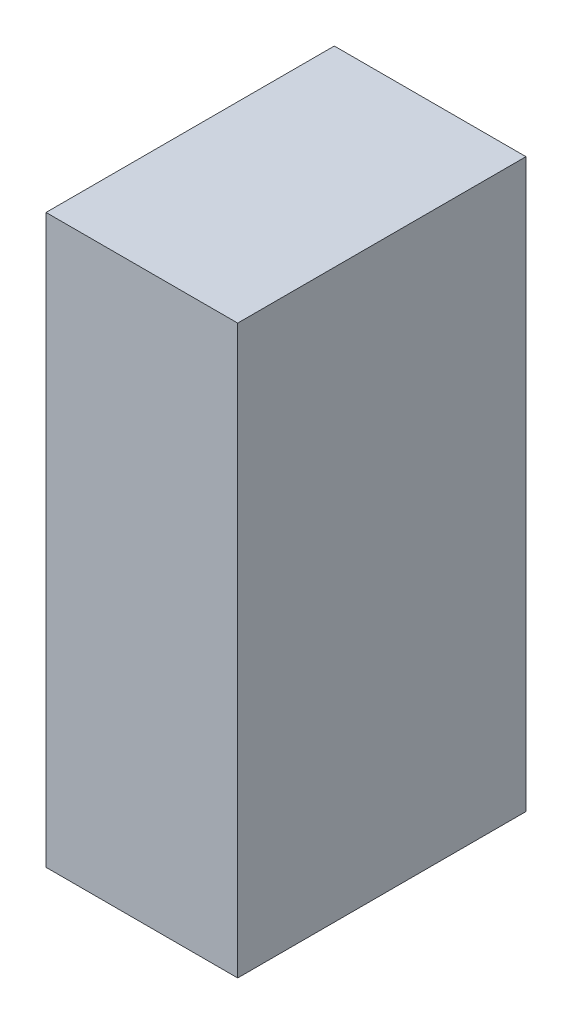
ISO-10303-21;
HEADER;
FILE_DESCRIPTION(('STEP AP214'),'2;1');
FILE_NAME('part.step','',(''),(''),'','','');
FILE_SCHEMA(('AUTOMOTIVE_DESIGN { 1 0 10303 214 1 1 1 1 }'));
ENDSEC;
DATA;
#1=APPLICATION_CONTEXT('core data for automotive mechanical design processes');
#2=APPLICATION_PROTOCOL_DEFINITION('international standard','automotive_design',2000,#1);
#3=PRODUCT_CONTEXT('',#1,'mechanical');
#4=PRODUCT('Part','Part','',(#3));
#5=PRODUCT_RELATED_PRODUCT_CATEGORY('part','',(#4));
#6=PRODUCT_DEFINITION_FORMATION('','',#4);
#7=PRODUCT_DEFINITION_CONTEXT('part definition',#1,'design');
#8=PRODUCT_DEFINITION('design','',#6,#7);
#9=PRODUCT_DEFINITION_SHAPE('','',#8);
#10=(LENGTH_UNIT() NAMED_UNIT(*) SI_UNIT(.MILLI.,.METRE.));
#11=(NAMED_UNIT(*) PLANE_ANGLE_UNIT() SI_UNIT($,.RADIAN.));
#12=(NAMED_UNIT(*) SI_UNIT($,.STERADIAN.) SOLID_ANGLE_UNIT());
#13=UNCERTAINTY_MEASURE_WITH_UNIT(LENGTH_MEASURE(1.E-05),#10,'distance_accuracy_value','');
#14=(GEOMETRIC_REPRESENTATION_CONTEXT(3) GLOBAL_UNCERTAINTY_ASSIGNED_CONTEXT((#13)) GLOBAL_UNIT_ASSIGNED_CONTEXT((#10,
#11,#12)) REPRESENTATION_CONTEXT('',''));
#15=CARTESIAN_POINT('',(0.,0.,0.));
#16=DIRECTION('',(0.,0.,1.));
#17=DIRECTION('',(1.,0.,0.));
#18=AXIS2_PLACEMENT_3D('',#15,#16,#17);
#19=CARTESIAN_POINT('',(-0.33774126,-0.99949,0.));
#20=DIRECTION('',(0.,1.,0.));
#21=DIRECTION('',(1.,0.,0.));
#22=AXIS2_PLACEMENT_3D('',#19,#20,#21);
#23=PLANE('',#22);
#24=DIRECTION('',(1.,0.,0.));
#25=VECTOR('',#24,1.);
#26=CARTESIAN_POINT('',(-0.33774126,-0.99949,0.));
#27=LINE('',#26,#25);
#28=CARTESIAN_POINT('',(-0.33774126,-0.99949,0.));
#29=VERTEX_POINT('',#28);
#30=CARTESIAN_POINT('',(0.3377438,-0.99949,0.));
#31=VERTEX_POINT('',#30);
#32=EDGE_CURVE('E11',#29,#31,#27,.T.);
#33=ORIENTED_EDGE('',*,*,#32,.T.);
#34=DIRECTION('',(0.,0.,1.));
#35=VECTOR('',#34,1.);
#36=CARTESIAN_POINT('',(0.3377438,-0.99949,0.));
#37=LINE('',#36,#35);
#38=CARTESIAN_POINT('',(0.3377438,-0.99949,1.016));
#39=VERTEX_POINT('',#38);
#40=EDGE_CURVE('E24',#31,#39,#37,.T.);
#41=ORIENTED_EDGE('',*,*,#40,.T.);
#42=DIRECTION('',(1.,0.,0.));
#43=VECTOR('',#42,1.);
#44=CARTESIAN_POINT('',(-0.33774126,-0.99949,1.016));
#45=LINE('',#44,#43);
#46=CARTESIAN_POINT('',(-0.33774126,-0.99949,1.016));
#47=VERTEX_POINT('',#46);
#48=EDGE_CURVE('E87',#47,#39,#45,.T.);
#49=ORIENTED_EDGE('',*,*,#48,.F.);
#50=DIRECTION('',(0.,0.,1.));
#51=VECTOR('',#50,1.);
#52=CARTESIAN_POINT('',(-0.33774126,-0.99949,0.));
#53=LINE('',#52,#51);
#54=EDGE_CURVE('E36',#29,#47,#53,.T.);
#55=ORIENTED_EDGE('',*,*,#54,.F.);
#56=EDGE_LOOP('',(#33,#41,#49,#55));
#57=FACE_BOUND('',#56,.T.);
#58=ADVANCED_FACE('F17',(#57),#23,.F.);
#59=CARTESIAN_POINT('',(0.3377438,-0.99949,0.));
#60=DIRECTION('',(-1.,0.,0.));
#61=DIRECTION('',(0.,1.,0.));
#62=AXIS2_PLACEMENT_3D('',#59,#60,#61);
#63=PLANE('',#62);
#64=DIRECTION('',(0.,1.,0.));
#65=VECTOR('',#64,1.);
#66=CARTESIAN_POINT('',(0.3377438,-0.99949,0.));
#67=LINE('',#66,#65);
#68=CARTESIAN_POINT('',(0.3377438,0.99949254,0.));
#69=VERTEX_POINT('',#68);
#70=EDGE_CURVE('E84',#31,#69,#67,.T.);
#71=ORIENTED_EDGE('',*,*,#70,.T.);
#72=DIRECTION('',(0.,0.,1.));
#73=VECTOR('',#72,1.);
#74=CARTESIAN_POINT('',(0.3377438,0.99949254,0.));
#75=LINE('',#74,#73);
#76=CARTESIAN_POINT('',(0.3377438,0.99949254,1.016));
#77=VERTEX_POINT('',#76);
#78=EDGE_CURVE('E82',#69,#77,#75,.T.);
#79=ORIENTED_EDGE('',*,*,#78,.T.);
#80=DIRECTION('',(0.,1.,0.));
#81=VECTOR('',#80,1.);
#82=CARTESIAN_POINT('',(0.3377438,-0.99949,1.016));
#83=LINE('',#82,#81);
#84=EDGE_CURVE('E62',#39,#77,#83,.T.);
#85=ORIENTED_EDGE('',*,*,#84,.F.);
#86=ORIENTED_EDGE('',*,*,#40,.F.);
#87=EDGE_LOOP('',(#71,#79,#85,#86));
#88=FACE_BOUND('',#87,.T.);
#89=ADVANCED_FACE('F89',(#88),#63,.F.);
#90=CARTESIAN_POINT('',(0.3377438,0.99949254,0.));
#91=DIRECTION('',(0.,-1.,0.));
#92=DIRECTION('',(-1.,0.,0.));
#93=AXIS2_PLACEMENT_3D('',#90,#91,#92);
#94=PLANE('',#93);
#95=DIRECTION('',(-1.,0.,0.));
#96=VECTOR('',#95,1.);
#97=CARTESIAN_POINT('',(0.3377438,0.99949254,0.));
#98=LINE('',#97,#96);
#99=CARTESIAN_POINT('',(-0.33774126,0.99949254,0.));
#100=VERTEX_POINT('',#99);
#101=EDGE_CURVE('E71',#69,#100,#98,.T.);
#102=ORIENTED_EDGE('',*,*,#101,.T.);
#103=DIRECTION('',(0.,0.,1.));
#104=VECTOR('',#103,1.);
#105=CARTESIAN_POINT('',(-0.33774126,0.99949254,0.));
#106=LINE('',#105,#104);
#107=CARTESIAN_POINT('',(-0.33774126,0.99949254,1.016));
#108=VERTEX_POINT('',#107);
#109=EDGE_CURVE('E65',#100,#108,#106,.T.);
#110=ORIENTED_EDGE('',*,*,#109,.T.);
#111=DIRECTION('',(-1.,0.,0.));
#112=VECTOR('',#111,1.);
#113=CARTESIAN_POINT('',(0.3377438,0.99949254,1.016));
#114=LINE('',#113,#112);
#115=EDGE_CURVE('E57',#77,#108,#114,.T.);
#116=ORIENTED_EDGE('',*,*,#115,.F.);
#117=ORIENTED_EDGE('',*,*,#78,.F.);
#118=EDGE_LOOP('',(#102,#110,#116,#117));
#119=FACE_BOUND('',#118,.T.);
#120=ADVANCED_FACE('F69',(#119),#94,.F.);
#121=CARTESIAN_POINT('',(-0.33774126,0.99949254,0.));
#122=DIRECTION('',(1.,0.,0.));
#123=DIRECTION('',(0.,-1.,0.));
#124=AXIS2_PLACEMENT_3D('',#121,#122,#123);
#125=PLANE('',#124);
#126=DIRECTION('',(0.,-1.,0.));
#127=VECTOR('',#126,1.);
#128=CARTESIAN_POINT('',(-0.33774126,0.99949254,0.));
#129=LINE('',#128,#127);
#130=EDGE_CURVE('E66',#100,#29,#129,.T.);
#131=ORIENTED_EDGE('',*,*,#130,.T.);
#132=ORIENTED_EDGE('',*,*,#54,.T.);
#133=DIRECTION('',(0.,-1.,0.));
#134=VECTOR('',#133,1.);
#135=CARTESIAN_POINT('',(-0.33774126,0.99949254,1.016));
#136=LINE('',#135,#134);
#137=EDGE_CURVE('E61',#108,#47,#136,.T.);
#138=ORIENTED_EDGE('',*,*,#137,.F.);
#139=ORIENTED_EDGE('',*,*,#109,.F.);
#140=EDGE_LOOP('',(#131,#132,#138,#139));
#141=FACE_BOUND('',#140,.T.);
#142=ADVANCED_FACE('F76',(#141),#125,.F.);
#143=CARTESIAN_POINT('',(-0.33774126,-0.99949,0.));
#144=DIRECTION('',(0.,0.,-1.));
#145=DIRECTION('',(-1.,0.,0.));
#146=AXIS2_PLACEMENT_3D('',#143,#144,#145);
#147=PLANE('',#146);
#148=ORIENTED_EDGE('',*,*,#130,.F.);
#149=ORIENTED_EDGE('',*,*,#101,.F.);
#150=ORIENTED_EDGE('',*,*,#70,.F.);
#151=ORIENTED_EDGE('',*,*,#32,.F.);
#152=EDGE_LOOP('',(#148,#149,#150,#151));
#153=FACE_BOUND('',#152,.T.);
#154=ADVANCED_FACE('F91',(#153),#147,.T.);
#155=CARTESIAN_POINT('',(-0.33774126,-0.99949,1.016));
#156=DIRECTION('',(0.,0.,-1.));
#157=DIRECTION('',(-1.,0.,0.));
#158=AXIS2_PLACEMENT_3D('',#155,#156,#157);
#159=PLANE('',#158);
#160=ORIENTED_EDGE('',*,*,#48,.T.);
#161=ORIENTED_EDGE('',*,*,#84,.T.);
#162=ORIENTED_EDGE('',*,*,#115,.T.);
#163=ORIENTED_EDGE('',*,*,#137,.T.);
#164=EDGE_LOOP('',(#160,#161,#162,#163));
#165=FACE_BOUND('',#164,.T.);
#166=ADVANCED_FACE('F59',(#165),#159,.F.);
#167=CLOSED_SHELL('',(#58,#89,#120,#142,#154,#166));
#168=MANIFOLD_SOLID_BREP('B1',#167);
#169=ADVANCED_BREP_SHAPE_REPRESENTATION('',(#18,#168),#14);
#170=SHAPE_DEFINITION_REPRESENTATION(#9,#169);
ENDSEC;
END-ISO-10303-21;
